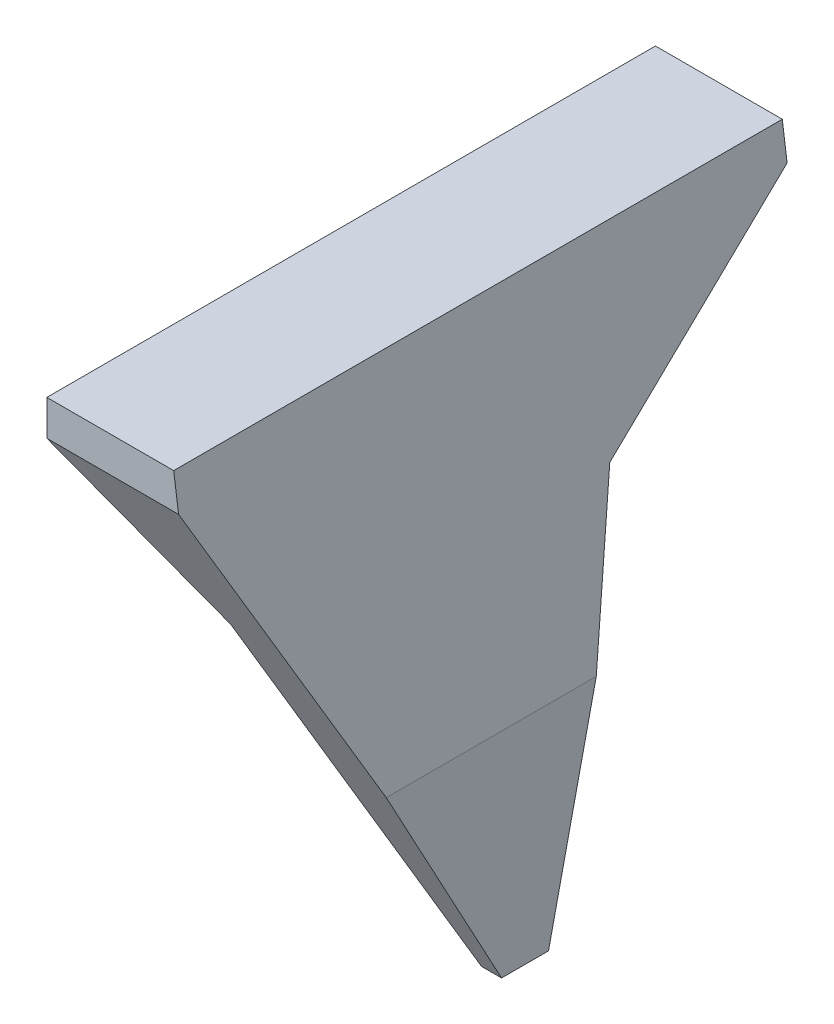
ISO-10303-21;
HEADER;
FILE_DESCRIPTION(('STEP AP214'),'2;1');
FILE_NAME('part.step','',(''),(''),'','','');
FILE_SCHEMA(('AUTOMOTIVE_DESIGN { 1 0 10303 214 1 1 1 1 }'));
ENDSEC;
DATA;
#1=APPLICATION_CONTEXT('core data for automotive mechanical design processes');
#2=APPLICATION_PROTOCOL_DEFINITION('international standard','automotive_design',2000,#1);
#3=PRODUCT_CONTEXT('',#1,'mechanical');
#4=PRODUCT('Part','Part','',(#3));
#5=PRODUCT_RELATED_PRODUCT_CATEGORY('part','',(#4));
#6=PRODUCT_DEFINITION_FORMATION('','',#4);
#7=PRODUCT_DEFINITION_CONTEXT('part definition',#1,'design');
#8=PRODUCT_DEFINITION('design','',#6,#7);
#9=PRODUCT_DEFINITION_SHAPE('','',#8);
#10=(LENGTH_UNIT() NAMED_UNIT(*) SI_UNIT(.MILLI.,.METRE.));
#11=(NAMED_UNIT(*) PLANE_ANGLE_UNIT() SI_UNIT($,.RADIAN.));
#12=(NAMED_UNIT(*) SI_UNIT($,.STERADIAN.) SOLID_ANGLE_UNIT());
#13=UNCERTAINTY_MEASURE_WITH_UNIT(LENGTH_MEASURE(1.E-05),#10,'distance_accuracy_value','');
#14=(GEOMETRIC_REPRESENTATION_CONTEXT(3) GLOBAL_UNCERTAINTY_ASSIGNED_CONTEXT((#13)) GLOBAL_UNIT_ASSIGNED_CONTEXT((#10,
#11,#12)) REPRESENTATION_CONTEXT('',''));
#15=CARTESIAN_POINT('',(0.,0.,0.));
#16=DIRECTION('',(0.,0.,1.));
#17=DIRECTION('',(1.,0.,0.));
#18=AXIS2_PLACEMENT_3D('',#15,#16,#17);
#19=CARTESIAN_POINT('',(9.99999999999999,68.,-35.));
#20=DIRECTION('',(-1.,0.,0.));
#21=DIRECTION('',(0.,0.,1.));
#22=AXIS2_PLACEMENT_3D('',#19,#20,#21);
#23=PLANE('',#22);
#24=DIRECTION('',(0.,-0.975949347844153,0.21799740925656));
#25=VECTOR('',#24,1.);
#26=CARTESIAN_POINT('',(9.99999999999999,71.8309558684956,-17.8492508501431));
#27=LINE('',#26,#25);
#28=CARTESIAN_POINT('',(10.,28.6102954138197,-8.19506948684818));
#29=VERTEX_POINT('',#28);
#30=CARTESIAN_POINT('',(9.99999999999999,4.01515028149824,-2.7012619127369));
#31=VERTEX_POINT('',#30);
#32=EDGE_CURVE('E257',#29,#31,#27,.T.);
#33=ORIENTED_EDGE('',*,*,#32,.F.);
#34=DIRECTION('',(0.,0.,1.));
#35=VECTOR('',#34,1.);
#36=CARTESIAN_POINT('',(9.99999999999999,28.6102954138197,-53.));
#37=LINE('',#36,#35);
#38=CARTESIAN_POINT('',(9.99999999999999,28.6102954138197,15.9613673314556));
#39=VERTEX_POINT('',#38);
#40=EDGE_CURVE('E110',#29,#39,#37,.T.);
#41=ORIENTED_EDGE('',*,*,#40,.T.);
#42=DIRECTION('',(0.,0.880223500538731,0.474559363093114));
#43=VECTOR('',#42,1.);
#44=CARTESIAN_POINT('',(10.,37.8416830637332,20.9383322056351));
#45=LINE('',#44,#43);
#46=CARTESIAN_POINT('',(9.99999999999999,4.01515028149824,2.7012619127369));
#47=VERTEX_POINT('',#46);
#48=EDGE_CURVE('E251',#47,#39,#45,.T.);
#49=ORIENTED_EDGE('',*,*,#48,.F.);
#50=DIRECTION('',(0.,0.,1.));
#51=VECTOR('',#50,1.);
#52=CARTESIAN_POINT('',(9.99999999999999,4.01515028149824,-35.));
#53=LINE('',#52,#51);
#54=EDGE_CURVE('E254',#31,#47,#53,.T.);
#55=ORIENTED_EDGE('',*,*,#54,.F.);
#56=EDGE_LOOP('',(#33,#41,#49,#55));
#57=FACE_BOUND('',#56,.T.);
#58=ADVANCED_FACE('F89',(#57),#23,.F.);
#59=CARTESIAN_POINT('',(-10.,68.,-35.));
#60=DIRECTION('',(0.,0.,1.));
#61=DIRECTION('',(1.,0.,0.));
#62=AXIS2_PLACEMENT_3D('',#59,#60,#61);
#63=PLANE('',#62);
#64=DIRECTION('',(-1.,0.,0.));
#65=VECTOR('',#64,1.);
#66=CARTESIAN_POINT('',(-10.,68.,-35.));
#67=LINE('',#66,#65);
#68=CARTESIAN_POINT('',(4.58859148671622,68.,-35.));
#69=VERTEX_POINT('',#68);
#70=CARTESIAN_POINT('',(-10.,68.,-35.));
#71=VERTEX_POINT('',#70);
#72=EDGE_CURVE('E225',#69,#71,#67,.T.);
#73=ORIENTED_EDGE('',*,*,#72,.F.);
#74=DIRECTION('',(0.136102918491098,-0.990694703517792,0.));
#75=VECTOR('',#74,1.);
#76=CARTESIAN_POINT('',(4.31835235350854,69.9670737477213,-35.));
#77=LINE('',#76,#75);
#78=CARTESIAN_POINT('',(5.148614739886,63.9235843219748,-35.));
#79=VERTEX_POINT('',#78);
#80=EDGE_CURVE('E210',#69,#79,#77,.T.);
#81=ORIENTED_EDGE('',*,*,#80,.T.);
#82=DIRECTION('',(1.,0.,0.));
#83=VECTOR('',#82,1.);
#84=CARTESIAN_POINT('',(-37.,63.9235843219748,-35.));
#85=LINE('',#84,#83);
#86=CARTESIAN_POINT('',(-10.,63.9235843219748,-35.));
#87=VERTEX_POINT('',#86);
#88=EDGE_CURVE('E198',#87,#79,#85,.T.);
#89=ORIENTED_EDGE('',*,*,#88,.F.);
#90=DIRECTION('',(0.,-1.,0.));
#91=VECTOR('',#90,1.);
#92=CARTESIAN_POINT('',(-10.,68.,-35.));
#93=LINE('',#92,#91);
#94=EDGE_CURVE('E208',#71,#87,#93,.T.);
#95=ORIENTED_EDGE('',*,*,#94,.F.);
#96=EDGE_LOOP('',(#73,#81,#89,#95));
#97=FACE_BOUND('',#96,.T.);
#98=ADVANCED_FACE('F207',(#97),#63,.F.);
#99=CARTESIAN_POINT('',(-10.,68.,-35.));
#100=DIRECTION('',(1.,0.,0.));
#101=DIRECTION('',(0.,0.,-1.));
#102=AXIS2_PLACEMENT_3D('',#99,#100,#101);
#103=PLANE('',#102);
#104=ORIENTED_EDGE('',*,*,#94,.T.);
#105=DIRECTION('',(0.,0.,1.));
#106=VECTOR('',#105,1.);
#107=CARTESIAN_POINT('',(-10.,63.9235843219748,-53.));
#108=LINE('',#107,#106);
#109=CARTESIAN_POINT('',(-10.,63.9235843219748,35.));
#110=VERTEX_POINT('',#109);
#111=EDGE_CURVE('E178',#87,#110,#108,.T.);
#112=ORIENTED_EDGE('',*,*,#111,.T.);
#113=DIRECTION('',(0.,-1.,0.));
#114=VECTOR('',#113,1.);
#115=CARTESIAN_POINT('',(-10.,68.,35.));
#116=LINE('',#115,#114);
#117=CARTESIAN_POINT('',(-10.,68.,35.));
#118=VERTEX_POINT('',#117);
#119=EDGE_CURVE('E215',#118,#110,#116,.T.);
#120=ORIENTED_EDGE('',*,*,#119,.F.);
#121=DIRECTION('',(0.,0.,1.));
#122=VECTOR('',#121,1.);
#123=CARTESIAN_POINT('',(-10.,68.,-35.));
#124=LINE('',#123,#122);
#125=EDGE_CURVE('E214',#71,#118,#124,.T.);
#126=ORIENTED_EDGE('',*,*,#125,.F.);
#127=EDGE_LOOP('',(#104,#112,#120,#126));
#128=FACE_BOUND('',#127,.T.);
#129=ADVANCED_FACE('F213',(#128),#103,.F.);
#130=CARTESIAN_POINT('',(-10.,68.,35.));
#131=DIRECTION('',(0.,0.,-1.));
#132=DIRECTION('',(-1.,0.,0.));
#133=AXIS2_PLACEMENT_3D('',#130,#131,#132);
#134=PLANE('',#133);
#135=DIRECTION('',(1.,0.,0.));
#136=VECTOR('',#135,1.);
#137=CARTESIAN_POINT('',(-37.,63.9235843219748,35.));
#138=LINE('',#137,#136);
#139=CARTESIAN_POINT('',(5.14861473988599,63.9235843219748,35.));
#140=VERTEX_POINT('',#139);
#141=EDGE_CURVE('E260',#110,#140,#138,.T.);
#142=ORIENTED_EDGE('',*,*,#141,.T.);
#143=DIRECTION('',(-0.136102918491098,0.990694703517792,0.));
#144=VECTOR('',#143,1.);
#145=CARTESIAN_POINT('',(4.31835235350853,69.9670737477213,35.));
#146=LINE('',#145,#144);
#147=CARTESIAN_POINT('',(4.58859148671622,68.,35.));
#148=VERTEX_POINT('',#147);
#149=EDGE_CURVE('E211',#140,#148,#146,.T.);
#150=ORIENTED_EDGE('',*,*,#149,.T.);
#151=DIRECTION('',(1.,0.,0.));
#152=VECTOR('',#151,1.);
#153=CARTESIAN_POINT('',(-10.,68.,35.));
#154=LINE('',#153,#152);
#155=EDGE_CURVE('E219',#118,#148,#154,.T.);
#156=ORIENTED_EDGE('',*,*,#155,.F.);
#157=ORIENTED_EDGE('',*,*,#119,.T.);
#158=EDGE_LOOP('',(#142,#150,#156,#157));
#159=FACE_BOUND('',#158,.T.);
#160=ADVANCED_FACE('F336',(#159),#134,.F.);
#161=CARTESIAN_POINT('',(0.,68.,0.));
#162=DIRECTION('',(0.,1.,0.));
#163=DIRECTION('',(0.,0.,1.));
#164=AXIS2_PLACEMENT_3D('',#161,#162,#163);
#165=PLANE('',#164);
#166=DIRECTION('',(0.,0.,1.));
#167=VECTOR('',#166,1.);
#168=CARTESIAN_POINT('',(4.58859148671622,68.,-53.));
#169=LINE('',#168,#167);
#170=EDGE_CURVE('E285',#69,#148,#169,.T.);
#171=ORIENTED_EDGE('',*,*,#170,.F.);
#172=ORIENTED_EDGE('',*,*,#72,.T.);
#173=ORIENTED_EDGE('',*,*,#125,.T.);
#174=ORIENTED_EDGE('',*,*,#155,.T.);
#175=EDGE_LOOP('',(#171,#172,#173,#174));
#176=FACE_BOUND('',#175,.T.);
#177=ADVANCED_FACE('F333',(#176),#165,.T.);
#178=CARTESIAN_POINT('',(-37.,63.9235843219748,-35.));
#179=DIRECTION('',(0.,-0.7970371022321,-0.603930341732768));
#180=DIRECTION('',(0.,0.603930341732768,-0.7970371022321));
#181=AXIS2_PLACEMENT_3D('',#178,#179,#180);
#182=PLANE('',#181);
#183=DIRECTION('',(0.382880302464453,-0.557909618683098,0.736301250416981));
#184=VECTOR('',#183,1.);
#185=CARTESIAN_POINT('',(-13.9581278024123,69.6911246178035,-42.6117116275444));
#186=LINE('',#185,#184);
#187=CARTESIAN_POINT('',(1.84105798481559,46.6695231895764,-12.2289518568559));
#188=VERTEX_POINT('',#187);
#189=EDGE_CURVE('E181',#87,#188,#186,.T.);
#190=ORIENTED_EDGE('',*,*,#189,.F.);
#191=ORIENTED_EDGE('',*,*,#88,.T.);
#192=DIRECTION('',(-0.0826846261654644,0.601862341473831,-0.794307858774867));
#193=VECTOR('',#192,1.);
#194=CARTESIAN_POINT('',(4.86045530747572,66.0211001329691,-37.7681966087088));
#195=LINE('',#194,#193);
#196=CARTESIAN_POINT('',(7.51899995301444,46.6695231895764,-12.2289518568559));
#197=VERTEX_POINT('',#196);
#198=EDGE_CURVE('E273',#197,#79,#195,.T.);
#199=ORIENTED_EDGE('',*,*,#198,.F.);
#200=DIRECTION('',(1.,0.,0.));
#201=VECTOR('',#200,1.);
#202=CARTESIAN_POINT('',(-37.,46.6695231895764,-12.2289518568559));
#203=LINE('',#202,#201);
#204=EDGE_CURVE('E200',#188,#197,#203,.T.);
#205=ORIENTED_EDGE('',*,*,#204,.F.);
#206=EDGE_LOOP('',(#190,#191,#199,#205));
#207=FACE_BOUND('',#206,.T.);
#208=ADVANCED_FACE('F196',(#207),#182,.T.);
#209=CARTESIAN_POINT('',(-37.,4.01515028149824,2.7012619127369));
#210=DIRECTION('',(0.,-0.474559363093114,0.880223500538731));
#211=DIRECTION('',(0.,-0.880223500538731,-0.474559363093114));
#212=AXIS2_PLACEMENT_3D('',#209,#210,#211);
#213=PLANE('',#212);
#214=DIRECTION('',(-0.517059267762424,0.753426951078732,0.40619889587392));
#215=VECTOR('',#214,1.);
#216=CARTESIAN_POINT('',(12.9035230561977,30.5499797449435,17.0071191890423));
#217=LINE('',#216,#215);
#218=CARTESIAN_POINT('',(1.84105798481562,46.6695231895762,25.6977304551068));
#219=VERTEX_POINT('',#218);
#220=EDGE_CURVE('E185',#219,#110,#217,.T.);
#221=ORIENTED_EDGE('',*,*,#220,.F.);
#222=DIRECTION('',(-0.120051660483922,0.873857412526382,0.471127181754299));
#223=VECTOR('',#222,1.);
#224=CARTESIAN_POINT('',(7.05672252533413,8.70464122450322,5.22953096460987));
#225=LINE('',#224,#223);
#226=CARTESIAN_POINT('',(7.70097085058944,4.01515028149824,2.7012619127369));
#227=VERTEX_POINT('',#226);
#228=EDGE_CURVE('E275',#227,#219,#225,.T.);
#229=ORIENTED_EDGE('',*,*,#228,.F.);
#230=DIRECTION('',(1.,0.,0.));
#231=VECTOR('',#230,1.);
#232=CARTESIAN_POINT('',(-37.,4.01515028149824,2.7012619127369));
#233=LINE('',#232,#231);
#234=EDGE_CURVE('E263',#227,#47,#233,.T.);
#235=ORIENTED_EDGE('',*,*,#234,.T.);
#236=ORIENTED_EDGE('',*,*,#48,.T.);
#237=DIRECTION('',(0.120051660483904,-0.873857412526384,-0.4711271817543));
#238=VECTOR('',#237,1.);
#239=CARTESIAN_POINT('',(12.6528317159818,9.3003029501453,5.55067309381528));
#240=LINE('',#239,#238);
#241=EDGE_CURVE('E270',#140,#39,#240,.T.);
#242=ORIENTED_EDGE('',*,*,#241,.F.);
#243=ORIENTED_EDGE('',*,*,#141,.F.);
#244=EDGE_LOOP('',(#221,#229,#235,#236,#242,#243));
#245=FACE_BOUND('',#244,.T.);
#246=ADVANCED_FACE('F339',(#245),#213,.T.);
#247=CARTESIAN_POINT('',(-37.,4.01515028149824,-2.70126191273689));
#248=DIRECTION('',(0.,-1.,0.));
#249=DIRECTION('',(0.,0.,-1.));
#250=AXIS2_PLACEMENT_3D('',#247,#248,#249);
#251=PLANE('',#250);
#252=DIRECTION('',(0.,0.,1.));
#253=VECTOR('',#252,1.);
#254=CARTESIAN_POINT('',(7.70097085058944,4.01515028149824,-53.));
#255=LINE('',#254,#253);
#256=CARTESIAN_POINT('',(7.70097085058943,4.01515028149824,-2.7012619127369));
#257=VERTEX_POINT('',#256);
#258=EDGE_CURVE('E287',#257,#227,#255,.T.);
#259=ORIENTED_EDGE('',*,*,#258,.F.);
#260=DIRECTION('',(1.,0.,0.));
#261=VECTOR('',#260,1.);
#262=CARTESIAN_POINT('',(-37.,4.01515028149824,-2.70126191273689));
#263=LINE('',#262,#261);
#264=EDGE_CURVE('E265',#257,#31,#263,.T.);
#265=ORIENTED_EDGE('',*,*,#264,.T.);
#266=ORIENTED_EDGE('',*,*,#54,.T.);
#267=ORIENTED_EDGE('',*,*,#234,.F.);
#268=EDGE_LOOP('',(#259,#265,#266,#267));
#269=FACE_BOUND('',#268,.T.);
#270=ADVANCED_FACE('F342',(#269),#251,.T.);
#271=CARTESIAN_POINT('',(-37.,46.6695231895764,-12.2289518568559));
#272=DIRECTION('',(0.,-0.21799740925656,-0.975949347844153));
#273=DIRECTION('',(0.,0.975949347844153,-0.21799740925656));
#274=AXIS2_PLACEMENT_3D('',#271,#272,#273);
#275=PLANE('',#274);
#276=DIRECTION('',(0.132888059019742,-0.967293704581431,0.216064001738137));
#277=VECTOR('',#276,1.);
#278=CARTESIAN_POINT('',(1.15515456643726,51.6622220328161,-13.344168968716));
#279=LINE('',#278,#277);
#280=EDGE_CURVE('E201',#188,#257,#279,.T.);
#281=ORIENTED_EDGE('',*,*,#280,.F.);
#282=ORIENTED_EDGE('',*,*,#204,.T.);
#283=DIRECTION('',(-0.132888059019723,0.967293704581433,-0.216064001738137));
#284=VECTOR('',#283,1.);
#285=CARTESIAN_POINT('',(6.7328284161195,52.3920748166321,-13.5071958884655));
#286=LINE('',#285,#284);
#287=EDGE_CURVE('E12',#29,#197,#286,.T.);
#288=ORIENTED_EDGE('',*,*,#287,.F.);
#289=ORIENTED_EDGE('',*,*,#32,.T.);
#290=ORIENTED_EDGE('',*,*,#264,.F.);
#291=EDGE_LOOP('',(#281,#282,#288,#289,#290));
#292=FACE_BOUND('',#291,.T.);
#293=ADVANCED_FACE('F330',(#292),#275,.T.);
#294=CARTESIAN_POINT('',(1.84105798481562,46.6695231895762,-53.));
#295=DIRECTION('',(0.824512558085476,0.565843654695662,0.));
#296=DIRECTION('',(-0.565843654695662,0.824512558085476,0.));
#297=AXIS2_PLACEMENT_3D('',#294,#295,#296);
#298=PLANE('',#297);
#299=ORIENTED_EDGE('',*,*,#189,.T.);
#300=DIRECTION('',(0.,0.,1.));
#301=VECTOR('',#300,1.);
#302=CARTESIAN_POINT('',(1.84105798481562,46.6695231895762,-53.));
#303=LINE('',#302,#301);
#304=CARTESIAN_POINT('',(1.84105798481562,46.6695231895762,-7.92440064403334));
#305=VERTEX_POINT('',#304);
#306=EDGE_CURVE('E103',#188,#305,#303,.T.);
#307=ORIENTED_EDGE('',*,*,#306,.T.);
#308=DIRECTION('',(0.565843654695662,-0.824512558085476,0.));
#309=VECTOR('',#308,1.);
#310=CARTESIAN_POINT('',(-7.41075576912363,60.1506969411731,-7.92440064403334));
#311=LINE('',#310,#309);
#312=CARTESIAN_POINT('',(-8.50000000000001,61.737876614793,-7.92440064403334));
#313=VERTEX_POINT('',#312);
#314=EDGE_CURVE('E279',#313,#305,#311,.T.);
#315=ORIENTED_EDGE('',*,*,#314,.F.);
#316=DIRECTION('',(0.,0.,-1.));
#317=VECTOR('',#316,1.);
#318=CARTESIAN_POINT('',(-8.50000000000001,61.737876614793,6.32007413327887));
#319=LINE('',#318,#317);
#320=CARTESIAN_POINT('',(-8.50000000000001,61.737876614793,6.32007413327887));
#321=VERTEX_POINT('',#320);
#322=EDGE_CURVE('E96',#321,#313,#319,.T.);
#323=ORIENTED_EDGE('',*,*,#322,.F.);
#324=DIRECTION('',(-0.565843654695662,0.824512558085476,0.));
#325=VECTOR('',#324,1.);
#326=CARTESIAN_POINT('',(-7.41075576912363,60.1506969411731,6.32007413327887));
#327=LINE('',#326,#325);
#328=CARTESIAN_POINT('',(1.84105798481562,46.6695231895762,6.32007413327887));
#329=VERTEX_POINT('',#328);
#330=EDGE_CURVE('E282',#329,#321,#327,.T.);
#331=ORIENTED_EDGE('',*,*,#330,.F.);
#332=EDGE_CURVE('E190',#329,#219,#303,.T.);
#333=ORIENTED_EDGE('',*,*,#332,.T.);
#334=ORIENTED_EDGE('',*,*,#220,.T.);
#335=ORIENTED_EDGE('',*,*,#111,.F.);
#336=EDGE_LOOP('',(#299,#307,#315,#323,#331,#333,#334,#335));
#337=FACE_BOUND('',#336,.T.);
#338=ADVANCED_FACE('F180',(#337),#298,.F.);
#339=CARTESIAN_POINT('',(7.70097085058944,4.01515028149824,-53.));
#340=DIRECTION('',(0.990694703517789,0.136102918491118,0.));
#341=DIRECTION('',(-0.136102918491118,0.990694703517789,0.));
#342=AXIS2_PLACEMENT_3D('',#339,#340,#341);
#343=PLANE('',#342);
#344=ORIENTED_EDGE('',*,*,#228,.T.);
#345=ORIENTED_EDGE('',*,*,#332,.F.);
#346=EDGE_CURVE('E290',#305,#329,#303,.T.);
#347=ORIENTED_EDGE('',*,*,#346,.F.);
#348=ORIENTED_EDGE('',*,*,#306,.F.);
#349=ORIENTED_EDGE('',*,*,#280,.T.);
#350=ORIENTED_EDGE('',*,*,#258,.T.);
#351=EDGE_LOOP('',(#344,#345,#347,#348,#349,#350));
#352=FACE_BOUND('',#351,.T.);
#353=ADVANCED_FACE('F379',(#352),#343,.F.);
#354=CARTESIAN_POINT('',(13.6724703505327,1.87834164357889,-53.));
#355=DIRECTION('',(-0.990694703517792,-0.136102918491098,0.));
#356=DIRECTION('',(0.136102918491098,-0.990694703517792,0.));
#357=AXIS2_PLACEMENT_3D('',#354,#355,#356);
#358=PLANE('',#357);
#359=ORIENTED_EDGE('',*,*,#241,.T.);
#360=ORIENTED_EDGE('',*,*,#40,.F.);
#361=ORIENTED_EDGE('',*,*,#287,.T.);
#362=ORIENTED_EDGE('',*,*,#198,.T.);
#363=ORIENTED_EDGE('',*,*,#80,.F.);
#364=ORIENTED_EDGE('',*,*,#170,.T.);
#365=ORIENTED_EDGE('',*,*,#149,.F.);
#366=EDGE_LOOP('',(#359,#360,#361,#362,#363,#364,#365));
#367=FACE_BOUND('',#366,.T.);
#368=ADVANCED_FACE('F316',(#367),#358,.F.);
#369=CARTESIAN_POINT('',(0.,66.5,0.));
#370=DIRECTION('',(0.,1.,0.));
#371=DIRECTION('',(0.,0.,1.));
#372=AXIS2_PLACEMENT_3D('',#369,#370,#371);
#373=PLANE('',#372);
#374=DIRECTION('',(0.,0.,-1.));
#375=VECTOR('',#374,1.);
#376=CARTESIAN_POINT('',(-8.50000000000001,66.5,6.32007413327887));
#377=LINE('',#376,#375);
#378=CARTESIAN_POINT('',(-8.50000000000001,66.5,6.32007413327887));
#379=VERTEX_POINT('',#378);
#380=CARTESIAN_POINT('',(-8.50000000000001,66.5,-7.92440064403334));
#381=VERTEX_POINT('',#380);
#382=EDGE_CURVE('E248',#379,#381,#377,.T.);
#383=ORIENTED_EDGE('',*,*,#382,.T.);
#384=DIRECTION('',(1.,0.,0.));
#385=VECTOR('',#384,1.);
#386=CARTESIAN_POINT('',(1.84105798481688,66.5,-7.92440064403334));
#387=LINE('',#386,#385);
#388=CARTESIAN_POINT('',(1.84105798481688,66.5,-7.92440064403334));
#389=VERTEX_POINT('',#388);
#390=EDGE_CURVE('E245',#381,#389,#387,.T.);
#391=ORIENTED_EDGE('',*,*,#390,.T.);
#392=DIRECTION('',(0.,0.,1.));
#393=VECTOR('',#392,1.);
#394=CARTESIAN_POINT('',(1.84105798481688,66.5,6.32007413327887));
#395=LINE('',#394,#393);
#396=CARTESIAN_POINT('',(1.84105798481688,66.5,6.32007413327887));
#397=VERTEX_POINT('',#396);
#398=EDGE_CURVE('E242',#389,#397,#395,.T.);
#399=ORIENTED_EDGE('',*,*,#398,.T.);
#400=DIRECTION('',(-1.,0.,0.));
#401=VECTOR('',#400,1.);
#402=CARTESIAN_POINT('',(1.84105798481688,66.5,6.32007413327887));
#403=LINE('',#402,#401);
#404=EDGE_CURVE('E232',#397,#379,#403,.T.);
#405=ORIENTED_EDGE('',*,*,#404,.T.);
#406=EDGE_LOOP('',(#383,#391,#399,#405));
#407=FACE_BOUND('',#406,.T.);
#408=ADVANCED_FACE('F303',(#407),#373,.F.);
#409=CARTESIAN_POINT('',(-8.50000000000001,66.5,6.32007413327887));
#410=DIRECTION('',(-1.,0.,0.));
#411=DIRECTION('',(0.,0.,1.));
#412=AXIS2_PLACEMENT_3D('',#409,#410,#411);
#413=PLANE('',#412);
#414=DIRECTION('',(0.,-1.,0.));
#415=VECTOR('',#414,1.);
#416=CARTESIAN_POINT('',(-8.50000000000001,66.5,6.32007413327887));
#417=LINE('',#416,#415);
#418=EDGE_CURVE('E227',#379,#321,#417,.T.);
#419=ORIENTED_EDGE('',*,*,#418,.T.);
#420=ORIENTED_EDGE('',*,*,#322,.T.);
#421=DIRECTION('',(0.,-1.,0.));
#422=VECTOR('',#421,1.);
#423=CARTESIAN_POINT('',(-8.50000000000001,66.5,-7.92440064403334));
#424=LINE('',#423,#422);
#425=EDGE_CURVE('E228',#381,#313,#424,.T.);
#426=ORIENTED_EDGE('',*,*,#425,.F.);
#427=ORIENTED_EDGE('',*,*,#382,.F.);
#428=EDGE_LOOP('',(#419,#420,#426,#427));
#429=FACE_BOUND('',#428,.T.);
#430=ADVANCED_FACE('F308',(#429),#413,.F.);
#431=CARTESIAN_POINT('',(1.84105798481688,66.5,6.32007413327887));
#432=DIRECTION('',(0.,0.,1.));
#433=DIRECTION('',(1.,0.,0.));
#434=AXIS2_PLACEMENT_3D('',#431,#432,#433);
#435=PLANE('',#434);
#436=DIRECTION('',(0.,-1.,0.));
#437=VECTOR('',#436,1.);
#438=CARTESIAN_POINT('',(1.84105798481688,66.5,6.32007413327887));
#439=LINE('',#438,#437);
#440=EDGE_CURVE('E235',#397,#329,#439,.T.);
#441=ORIENTED_EDGE('',*,*,#440,.T.);
#442=ORIENTED_EDGE('',*,*,#330,.T.);
#443=ORIENTED_EDGE('',*,*,#418,.F.);
#444=ORIENTED_EDGE('',*,*,#404,.F.);
#445=EDGE_LOOP('',(#441,#442,#443,#444));
#446=FACE_BOUND('',#445,.T.);
#447=ADVANCED_FACE('F300',(#446),#435,.F.);
#448=CARTESIAN_POINT('',(1.84105798481688,66.5,6.32007413327887));
#449=DIRECTION('',(1.,0.,0.));
#450=DIRECTION('',(0.,0.,-1.));
#451=AXIS2_PLACEMENT_3D('',#448,#449,#450);
#452=PLANE('',#451);
#453=DIRECTION('',(0.,-1.,0.));
#454=VECTOR('',#453,1.);
#455=CARTESIAN_POINT('',(1.84105798481688,66.5,-7.92440064403334));
#456=LINE('',#455,#454);
#457=EDGE_CURVE('E231',#389,#305,#456,.T.);
#458=ORIENTED_EDGE('',*,*,#457,.T.);
#459=ORIENTED_EDGE('',*,*,#346,.T.);
#460=ORIENTED_EDGE('',*,*,#440,.F.);
#461=ORIENTED_EDGE('',*,*,#398,.F.);
#462=EDGE_LOOP('',(#458,#459,#460,#461));
#463=FACE_BOUND('',#462,.T.);
#464=ADVANCED_FACE('F295',(#463),#452,.F.);
#465=CARTESIAN_POINT('',(1.84105798481688,66.5,-7.92440064403334));
#466=DIRECTION('',(0.,0.,-1.));
#467=DIRECTION('',(-1.,0.,0.));
#468=AXIS2_PLACEMENT_3D('',#465,#466,#467);
#469=PLANE('',#468);
#470=ORIENTED_EDGE('',*,*,#425,.T.);
#471=ORIENTED_EDGE('',*,*,#314,.T.);
#472=ORIENTED_EDGE('',*,*,#457,.F.);
#473=ORIENTED_EDGE('',*,*,#390,.F.);
#474=EDGE_LOOP('',(#470,#471,#472,#473));
#475=FACE_BOUND('',#474,.T.);
#476=ADVANCED_FACE('F306',(#475),#469,.F.);
#477=CLOSED_SHELL('',(#58,#98,#129,#160,#177,#208,#246,#270,#293,#338,#353,#368,#408,#430,#447,
#464,#476));
#478=MANIFOLD_SOLID_BREP('B2',#477);
#479=ADVANCED_BREP_SHAPE_REPRESENTATION('',(#18,#478),#14);
#480=SHAPE_DEFINITION_REPRESENTATION(#9,#479);
ENDSEC;
END-ISO-10303-21;
